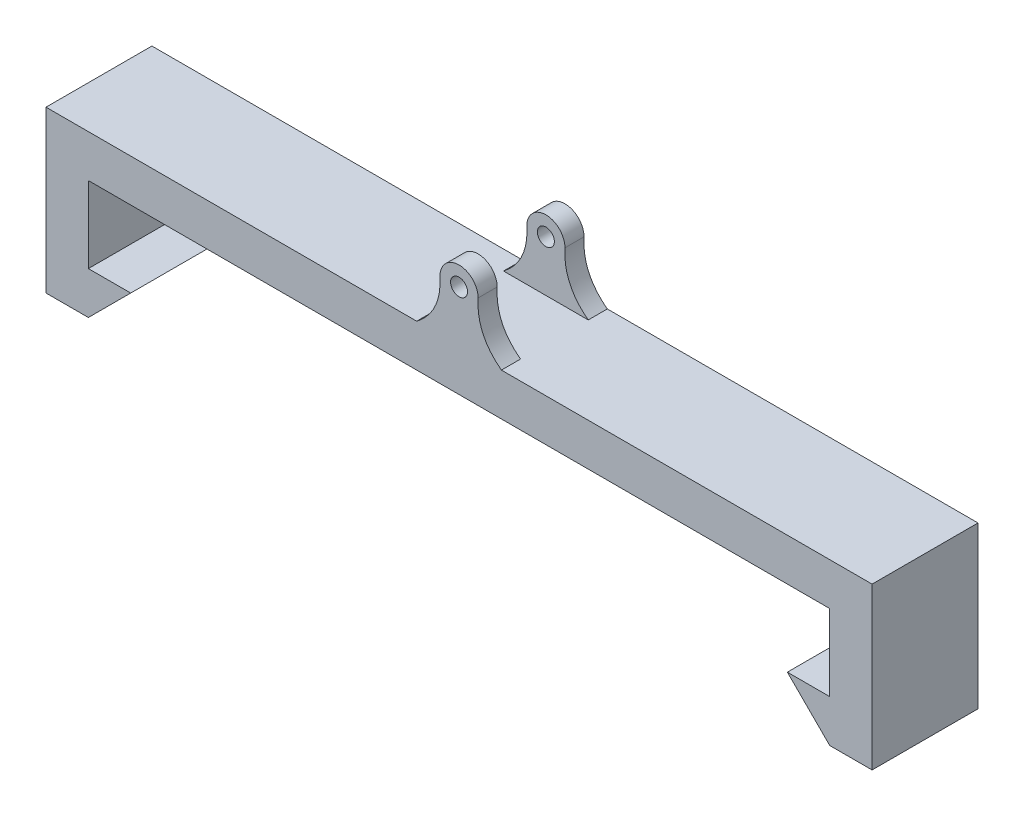
ISO-10303-21;
HEADER;
FILE_DESCRIPTION(('STEP AP214'),'2;1');
FILE_NAME('part.step','',(''),(''),'','','');
FILE_SCHEMA(('AUTOMOTIVE_DESIGN { 1 0 10303 214 1 1 1 1 }'));
ENDSEC;
DATA;
#1=APPLICATION_CONTEXT('core data for automotive mechanical design processes');
#2=APPLICATION_PROTOCOL_DEFINITION('international standard','automotive_design',2000,#1);
#3=PRODUCT_CONTEXT('',#1,'mechanical');
#4=PRODUCT('Part','Part','',(#3));
#5=PRODUCT_RELATED_PRODUCT_CATEGORY('part','',(#4));
#6=PRODUCT_DEFINITION_FORMATION('','',#4);
#7=PRODUCT_DEFINITION_CONTEXT('part definition',#1,'design');
#8=PRODUCT_DEFINITION('design','',#6,#7);
#9=PRODUCT_DEFINITION_SHAPE('','',#8);
#10=(LENGTH_UNIT() NAMED_UNIT(*) SI_UNIT(.MILLI.,.METRE.));
#11=(NAMED_UNIT(*) PLANE_ANGLE_UNIT() SI_UNIT($,.RADIAN.));
#12=(NAMED_UNIT(*) SI_UNIT($,.STERADIAN.) SOLID_ANGLE_UNIT());
#13=UNCERTAINTY_MEASURE_WITH_UNIT(LENGTH_MEASURE(1.E-05),#10,'distance_accuracy_value','');
#14=(GEOMETRIC_REPRESENTATION_CONTEXT(3) GLOBAL_UNCERTAINTY_ASSIGNED_CONTEXT((#13)) GLOBAL_UNIT_ASSIGNED_CONTEXT((#10,
#11,#12)) REPRESENTATION_CONTEXT('',''));
#15=CARTESIAN_POINT('',(0.,0.,0.));
#16=DIRECTION('',(0.,0.,1.));
#17=DIRECTION('',(1.,0.,0.));
#18=AXIS2_PLACEMENT_3D('',#15,#16,#17);
#19=CARTESIAN_POINT('',(0.,0.,25.));
#20=DIRECTION('',(0.,-1.,0.));
#21=DIRECTION('',(0.,0.,-1.));
#22=AXIS2_PLACEMENT_3D('',#19,#20,#21);
#23=PLANE('',#22);
#24=DIRECTION('',(-1.,0.,0.));
#25=VECTOR('',#24,1.);
#26=CARTESIAN_POINT('',(0.,0.,0.));
#27=LINE('',#26,#25);
#28=CARTESIAN_POINT('',(195.,0.,0.));
#29=VERTEX_POINT('',#28);
#30=CARTESIAN_POINT('',(107.5,0.,0.));
#31=VERTEX_POINT('',#30);
#32=EDGE_CURVE('E377',#29,#31,#27,.T.);
#33=ORIENTED_EDGE('',*,*,#32,.T.);
#34=DIRECTION('',(0.,0.,-1.));
#35=VECTOR('',#34,1.);
#36=CARTESIAN_POINT('',(107.5,0.,4.5));
#37=LINE('',#36,#35);
#38=CARTESIAN_POINT('',(107.5,0.,4.5));
#39=VERTEX_POINT('',#38);
#40=EDGE_CURVE('E57',#39,#31,#37,.T.);
#41=ORIENTED_EDGE('',*,*,#40,.F.);
#42=DIRECTION('',(-1.,0.,0.));
#43=VECTOR('',#42,1.);
#44=CARTESIAN_POINT('',(97.5,0.,4.5));
#45=LINE('',#44,#43);
#46=CARTESIAN_POINT('',(87.5,0.,4.5));
#47=VERTEX_POINT('',#46);
#48=EDGE_CURVE('E52',#39,#47,#45,.T.);
#49=ORIENTED_EDGE('',*,*,#48,.T.);
#50=DIRECTION('',(0.,0.,-1.));
#51=VECTOR('',#50,1.);
#52=CARTESIAN_POINT('',(87.5,0.,4.5));
#53=LINE('',#52,#51);
#54=CARTESIAN_POINT('',(87.5,0.,0.));
#55=VERTEX_POINT('',#54);
#56=EDGE_CURVE('E184',#47,#55,#53,.T.);
#57=ORIENTED_EDGE('',*,*,#56,.T.);
#58=CARTESIAN_POINT('',(0.,0.,0.));
#59=VERTEX_POINT('',#58);
#60=EDGE_CURVE('E376',#55,#59,#27,.T.);
#61=ORIENTED_EDGE('',*,*,#60,.T.);
#62=DIRECTION('',(0.,0.,-1.));
#63=VECTOR('',#62,1.);
#64=CARTESIAN_POINT('',(0.,0.,25.));
#65=LINE('',#64,#63);
#66=CARTESIAN_POINT('',(0.,0.,25.));
#67=VERTEX_POINT('',#66);
#68=EDGE_CURVE('E379',#67,#59,#65,.T.);
#69=ORIENTED_EDGE('',*,*,#68,.F.);
#70=DIRECTION('',(-1.,0.,0.));
#71=VECTOR('',#70,1.);
#72=CARTESIAN_POINT('',(0.,0.,25.));
#73=LINE('',#72,#71);
#74=CARTESIAN_POINT('',(87.5,0.,25.));
#75=VERTEX_POINT('',#74);
#76=EDGE_CURVE('E411',#75,#67,#73,.T.);
#77=ORIENTED_EDGE('',*,*,#76,.F.);
#78=DIRECTION('',(0.,0.,1.));
#79=VECTOR('',#78,1.);
#80=CARTESIAN_POINT('',(87.5,0.,20.5));
#81=LINE('',#80,#79);
#82=CARTESIAN_POINT('',(87.5,0.,20.5));
#83=VERTEX_POINT('',#82);
#84=EDGE_CURVE('E249',#83,#75,#81,.T.);
#85=ORIENTED_EDGE('',*,*,#84,.F.);
#86=DIRECTION('',(1.,0.,0.));
#87=VECTOR('',#86,1.);
#88=CARTESIAN_POINT('',(97.5,0.,20.5));
#89=LINE('',#88,#87);
#90=CARTESIAN_POINT('',(107.5,0.,20.5));
#91=VERTEX_POINT('',#90);
#92=EDGE_CURVE('E268',#83,#91,#89,.T.);
#93=ORIENTED_EDGE('',*,*,#92,.T.);
#94=DIRECTION('',(0.,0.,1.));
#95=VECTOR('',#94,1.);
#96=CARTESIAN_POINT('',(107.5,0.,20.5));
#97=LINE('',#96,#95);
#98=CARTESIAN_POINT('',(107.5,0.,25.));
#99=VERTEX_POINT('',#98);
#100=EDGE_CURVE('E236',#91,#99,#97,.T.);
#101=ORIENTED_EDGE('',*,*,#100,.T.);
#102=CARTESIAN_POINT('',(195.,0.,25.));
#103=VERTEX_POINT('',#102);
#104=EDGE_CURVE('E383',#103,#99,#73,.T.);
#105=ORIENTED_EDGE('',*,*,#104,.F.);
#106=DIRECTION('',(0.,0.,-1.));
#107=VECTOR('',#106,1.);
#108=CARTESIAN_POINT('',(195.,0.,25.));
#109=LINE('',#108,#107);
#110=EDGE_CURVE('E382',#103,#29,#109,.T.);
#111=ORIENTED_EDGE('',*,*,#110,.T.);
#112=EDGE_LOOP('',(#33,#41,#49,#57,#61,#69,#77,#85,#93,#101,#105,#111));
#113=FACE_BOUND('',#112,.T.);
#114=ADVANCED_FACE('F33',(#113),#23,.F.);
#115=CARTESIAN_POINT('',(0.,0.,25.));
#116=DIRECTION('',(1.,0.,0.));
#117=DIRECTION('',(0.,0.,-1.));
#118=AXIS2_PLACEMENT_3D('',#115,#116,#117);
#119=PLANE('',#118);
#120=DIRECTION('',(0.,-1.,0.));
#121=VECTOR('',#120,1.);
#122=CARTESIAN_POINT('',(0.,0.,0.));
#123=LINE('',#122,#121);
#124=CARTESIAN_POINT('',(0.,-38.,0.));
#125=VERTEX_POINT('',#124);
#126=EDGE_CURVE('E265',#59,#125,#123,.T.);
#127=ORIENTED_EDGE('',*,*,#126,.T.);
#128=DIRECTION('',(0.,0.,-1.));
#129=VECTOR('',#128,1.);
#130=CARTESIAN_POINT('',(0.,-38.,25.));
#131=LINE('',#130,#129);
#132=CARTESIAN_POINT('',(0.,-38.,25.));
#133=VERTEX_POINT('',#132);
#134=EDGE_CURVE('E11',#133,#125,#131,.T.);
#135=ORIENTED_EDGE('',*,*,#134,.F.);
#136=DIRECTION('',(0.,-1.,0.));
#137=VECTOR('',#136,1.);
#138=CARTESIAN_POINT('',(0.,0.,25.));
#139=LINE('',#138,#137);
#140=EDGE_CURVE('E254',#67,#133,#139,.T.);
#141=ORIENTED_EDGE('',*,*,#140,.F.);
#142=ORIENTED_EDGE('',*,*,#68,.T.);
#143=EDGE_LOOP('',(#127,#135,#141,#142));
#144=FACE_BOUND('',#143,.T.);
#145=ADVANCED_FACE('F35',(#144),#119,.F.);
#146=CARTESIAN_POINT('',(0.,-38.,25.));
#147=DIRECTION('',(0.,1.,0.));
#148=DIRECTION('',(0.,0.,1.));
#149=AXIS2_PLACEMENT_3D('',#146,#147,#148);
#150=PLANE('',#149);
#151=DIRECTION('',(1.,0.,0.));
#152=VECTOR('',#151,1.);
#153=CARTESIAN_POINT('',(0.,-38.,0.));
#154=LINE('',#153,#152);
#155=CARTESIAN_POINT('',(10.,-38.,0.));
#156=VERTEX_POINT('',#155);
#157=EDGE_CURVE('E340',#125,#156,#154,.T.);
#158=ORIENTED_EDGE('',*,*,#157,.T.);
#159=DIRECTION('',(0.,0.,-1.));
#160=VECTOR('',#159,1.);
#161=CARTESIAN_POINT('',(10.,-38.,25.));
#162=LINE('',#161,#160);
#163=CARTESIAN_POINT('',(10.,-38.,25.));
#164=VERTEX_POINT('',#163);
#165=EDGE_CURVE('E44',#164,#156,#162,.T.);
#166=ORIENTED_EDGE('',*,*,#165,.F.);
#167=DIRECTION('',(1.,0.,0.));
#168=VECTOR('',#167,1.);
#169=CARTESIAN_POINT('',(0.,-38.,25.));
#170=LINE('',#169,#168);
#171=EDGE_CURVE('E639',#133,#164,#170,.T.);
#172=ORIENTED_EDGE('',*,*,#171,.F.);
#173=ORIENTED_EDGE('',*,*,#134,.T.);
#174=EDGE_LOOP('',(#158,#166,#172,#173));
#175=FACE_BOUND('',#174,.T.);
#176=ADVANCED_FACE('F331',(#175),#150,.F.);
#177=CARTESIAN_POINT('',(20.,-28.,25.));
#178=DIRECTION('',(-0.707106781186547,0.707106781186548,0.));
#179=DIRECTION('',(-0.707106781186548,-0.707106781186547,0.));
#180=AXIS2_PLACEMENT_3D('',#177,#178,#179);
#181=PLANE('',#180);
#182=DIRECTION('',(0.707106781186548,0.707106781186547,0.));
#183=VECTOR('',#182,1.);
#184=CARTESIAN_POINT('',(20.,-28.,0.));
#185=LINE('',#184,#183);
#186=CARTESIAN_POINT('',(20.,-28.,0.));
#187=VERTEX_POINT('',#186);
#188=EDGE_CURVE('E347',#156,#187,#185,.T.);
#189=ORIENTED_EDGE('',*,*,#188,.T.);
#190=DIRECTION('',(0.,0.,-1.));
#191=VECTOR('',#190,1.);
#192=CARTESIAN_POINT('',(20.,-28.,25.));
#193=LINE('',#192,#191);
#194=CARTESIAN_POINT('',(20.,-28.,25.));
#195=VERTEX_POINT('',#194);
#196=EDGE_CURVE('E352',#195,#187,#193,.T.);
#197=ORIENTED_EDGE('',*,*,#196,.F.);
#198=DIRECTION('',(0.707106781186548,0.707106781186547,0.));
#199=VECTOR('',#198,1.);
#200=CARTESIAN_POINT('',(20.,-28.,25.));
#201=LINE('',#200,#199);
#202=EDGE_CURVE('E351',#164,#195,#201,.T.);
#203=ORIENTED_EDGE('',*,*,#202,.F.);
#204=ORIENTED_EDGE('',*,*,#165,.T.);
#205=EDGE_LOOP('',(#189,#197,#203,#204));
#206=FACE_BOUND('',#205,.T.);
#207=ADVANCED_FACE('F328',(#206),#181,.F.);
#208=CARTESIAN_POINT('',(10.,-28.,25.));
#209=DIRECTION('',(0.,-1.,0.));
#210=DIRECTION('',(0.,0.,-1.));
#211=AXIS2_PLACEMENT_3D('',#208,#209,#210);
#212=PLANE('',#211);
#213=DIRECTION('',(-1.,0.,0.));
#214=VECTOR('',#213,1.);
#215=CARTESIAN_POINT('',(10.,-28.,0.));
#216=LINE('',#215,#214);
#217=CARTESIAN_POINT('',(10.,-28.,0.));
#218=VERTEX_POINT('',#217);
#219=EDGE_CURVE('E357',#187,#218,#216,.T.);
#220=ORIENTED_EDGE('',*,*,#219,.T.);
#221=DIRECTION('',(0.,0.,-1.));
#222=VECTOR('',#221,1.);
#223=CARTESIAN_POINT('',(10.,-28.,25.));
#224=LINE('',#223,#222);
#225=CARTESIAN_POINT('',(10.,-28.,25.));
#226=VERTEX_POINT('',#225);
#227=EDGE_CURVE('E404',#226,#218,#224,.T.);
#228=ORIENTED_EDGE('',*,*,#227,.F.);
#229=DIRECTION('',(-1.,0.,0.));
#230=VECTOR('',#229,1.);
#231=CARTESIAN_POINT('',(10.,-28.,25.));
#232=LINE('',#231,#230);
#233=EDGE_CURVE('E637',#195,#226,#232,.T.);
#234=ORIENTED_EDGE('',*,*,#233,.F.);
#235=ORIENTED_EDGE('',*,*,#196,.T.);
#236=EDGE_LOOP('',(#220,#228,#234,#235));
#237=FACE_BOUND('',#236,.T.);
#238=ADVANCED_FACE('F324',(#237),#212,.F.);
#239=CARTESIAN_POINT('',(10.,-28.,25.));
#240=DIRECTION('',(-1.,0.,0.));
#241=DIRECTION('',(0.,-1.,0.));
#242=AXIS2_PLACEMENT_3D('',#239,#240,#241);
#243=PLANE('',#242);
#244=DIRECTION('',(0.,1.,0.));
#245=VECTOR('',#244,1.);
#246=CARTESIAN_POINT('',(10.,-28.,0.));
#247=LINE('',#246,#245);
#248=CARTESIAN_POINT('',(10.,-10.,0.));
#249=VERTEX_POINT('',#248);
#250=EDGE_CURVE('E359',#218,#249,#247,.T.);
#251=ORIENTED_EDGE('',*,*,#250,.T.);
#252=DIRECTION('',(0.,0.,-1.));
#253=VECTOR('',#252,1.);
#254=CARTESIAN_POINT('',(10.,-10.,25.));
#255=LINE('',#254,#253);
#256=CARTESIAN_POINT('',(10.,-10.,25.));
#257=VERTEX_POINT('',#256);
#258=EDGE_CURVE('E401',#257,#249,#255,.T.);
#259=ORIENTED_EDGE('',*,*,#258,.F.);
#260=DIRECTION('',(0.,1.,0.));
#261=VECTOR('',#260,1.);
#262=CARTESIAN_POINT('',(10.,-28.,25.));
#263=LINE('',#262,#261);
#264=EDGE_CURVE('E635',#226,#257,#263,.T.);
#265=ORIENTED_EDGE('',*,*,#264,.F.);
#266=ORIENTED_EDGE('',*,*,#227,.T.);
#267=EDGE_LOOP('',(#251,#259,#265,#266));
#268=FACE_BOUND('',#267,.T.);
#269=ADVANCED_FACE('F320',(#268),#243,.F.);
#270=CARTESIAN_POINT('',(10.,-10.,25.));
#271=DIRECTION('',(0.,1.,0.));
#272=DIRECTION('',(0.,0.,1.));
#273=AXIS2_PLACEMENT_3D('',#270,#271,#272);
#274=PLANE('',#273);
#275=DIRECTION('',(1.,0.,0.));
#276=VECTOR('',#275,1.);
#277=CARTESIAN_POINT('',(10.,-10.,0.));
#278=LINE('',#277,#276);
#279=CARTESIAN_POINT('',(185.,-10.,0.));
#280=VERTEX_POINT('',#279);
#281=EDGE_CURVE('E364',#249,#280,#278,.T.);
#282=ORIENTED_EDGE('',*,*,#281,.T.);
#283=DIRECTION('',(0.,0.,-1.));
#284=VECTOR('',#283,1.);
#285=CARTESIAN_POINT('',(185.,-10.,25.));
#286=LINE('',#285,#284);
#287=CARTESIAN_POINT('',(185.,-10.,25.));
#288=VERTEX_POINT('',#287);
#289=EDGE_CURVE('E398',#288,#280,#286,.T.);
#290=ORIENTED_EDGE('',*,*,#289,.F.);
#291=DIRECTION('',(1.,0.,0.));
#292=VECTOR('',#291,1.);
#293=CARTESIAN_POINT('',(10.,-10.,25.));
#294=LINE('',#293,#292);
#295=EDGE_CURVE('E633',#257,#288,#294,.T.);
#296=ORIENTED_EDGE('',*,*,#295,.F.);
#297=ORIENTED_EDGE('',*,*,#258,.T.);
#298=EDGE_LOOP('',(#282,#290,#296,#297));
#299=FACE_BOUND('',#298,.T.);
#300=ADVANCED_FACE('F316',(#299),#274,.F.);
#301=CARTESIAN_POINT('',(185.,-10.,25.));
#302=DIRECTION('',(1.,0.,0.));
#303=DIRECTION('',(0.,0.,-1.));
#304=AXIS2_PLACEMENT_3D('',#301,#302,#303);
#305=PLANE('',#304);
#306=DIRECTION('',(0.,-1.,0.));
#307=VECTOR('',#306,1.);
#308=CARTESIAN_POINT('',(185.,-10.,0.));
#309=LINE('',#308,#307);
#310=CARTESIAN_POINT('',(185.,-28.,0.));
#311=VERTEX_POINT('',#310);
#312=EDGE_CURVE('E366',#280,#311,#309,.T.);
#313=ORIENTED_EDGE('',*,*,#312,.T.);
#314=DIRECTION('',(0.,0.,-1.));
#315=VECTOR('',#314,1.);
#316=CARTESIAN_POINT('',(185.,-28.,25.));
#317=LINE('',#316,#315);
#318=CARTESIAN_POINT('',(185.,-28.,25.));
#319=VERTEX_POINT('',#318);
#320=EDGE_CURVE('E395',#319,#311,#317,.T.);
#321=ORIENTED_EDGE('',*,*,#320,.F.);
#322=DIRECTION('',(0.,-1.,0.));
#323=VECTOR('',#322,1.);
#324=CARTESIAN_POINT('',(185.,-10.,25.));
#325=LINE('',#324,#323);
#326=EDGE_CURVE('E631',#288,#319,#325,.T.);
#327=ORIENTED_EDGE('',*,*,#326,.F.);
#328=ORIENTED_EDGE('',*,*,#289,.T.);
#329=EDGE_LOOP('',(#313,#321,#327,#328));
#330=FACE_BOUND('',#329,.T.);
#331=ADVANCED_FACE('F312',(#330),#305,.F.);
#332=CARTESIAN_POINT('',(185.,-28.,25.));
#333=DIRECTION('',(0.,-1.,0.));
#334=DIRECTION('',(0.,0.,-1.));
#335=AXIS2_PLACEMENT_3D('',#332,#333,#334);
#336=PLANE('',#335);
#337=DIRECTION('',(-1.,0.,0.));
#338=VECTOR('',#337,1.);
#339=CARTESIAN_POINT('',(185.,-28.,0.));
#340=LINE('',#339,#338);
#341=CARTESIAN_POINT('',(175.,-28.,0.));
#342=VERTEX_POINT('',#341);
#343=EDGE_CURVE('E368',#311,#342,#340,.T.);
#344=ORIENTED_EDGE('',*,*,#343,.T.);
#345=DIRECTION('',(0.,0.,-1.));
#346=VECTOR('',#345,1.);
#347=CARTESIAN_POINT('',(175.,-28.,25.));
#348=LINE('',#347,#346);
#349=CARTESIAN_POINT('',(175.,-28.,25.));
#350=VERTEX_POINT('',#349);
#351=EDGE_CURVE('E392',#350,#342,#348,.T.);
#352=ORIENTED_EDGE('',*,*,#351,.F.);
#353=DIRECTION('',(-1.,0.,0.));
#354=VECTOR('',#353,1.);
#355=CARTESIAN_POINT('',(185.,-28.,25.));
#356=LINE('',#355,#354);
#357=EDGE_CURVE('E627',#319,#350,#356,.T.);
#358=ORIENTED_EDGE('',*,*,#357,.F.);
#359=ORIENTED_EDGE('',*,*,#320,.T.);
#360=EDGE_LOOP('',(#344,#352,#358,#359));
#361=FACE_BOUND('',#360,.T.);
#362=ADVANCED_FACE('F308',(#361),#336,.F.);
#363=CARTESIAN_POINT('',(185.,-38.,25.));
#364=DIRECTION('',(0.707106781186547,0.707106781186548,0.));
#365=DIRECTION('',(-0.707106781186548,0.707106781186547,0.));
#366=AXIS2_PLACEMENT_3D('',#363,#364,#365);
#367=PLANE('',#366);
#368=DIRECTION('',(0.707106781186548,-0.707106781186547,0.));
#369=VECTOR('',#368,1.);
#370=CARTESIAN_POINT('',(185.,-38.,0.));
#371=LINE('',#370,#369);
#372=CARTESIAN_POINT('',(185.,-38.,0.));
#373=VERTEX_POINT('',#372);
#374=EDGE_CURVE('E370',#342,#373,#371,.T.);
#375=ORIENTED_EDGE('',*,*,#374,.T.);
#376=DIRECTION('',(0.,0.,-1.));
#377=VECTOR('',#376,1.);
#378=CARTESIAN_POINT('',(185.,-38.,25.));
#379=LINE('',#378,#377);
#380=CARTESIAN_POINT('',(185.,-38.,25.));
#381=VERTEX_POINT('',#380);
#382=EDGE_CURVE('E389',#381,#373,#379,.T.);
#383=ORIENTED_EDGE('',*,*,#382,.F.);
#384=DIRECTION('',(0.707106781186548,-0.707106781186547,0.));
#385=VECTOR('',#384,1.);
#386=CARTESIAN_POINT('',(185.,-38.,25.));
#387=LINE('',#386,#385);
#388=EDGE_CURVE('E624',#350,#381,#387,.T.);
#389=ORIENTED_EDGE('',*,*,#388,.F.);
#390=ORIENTED_EDGE('',*,*,#351,.T.);
#391=EDGE_LOOP('',(#375,#383,#389,#390));
#392=FACE_BOUND('',#391,.T.);
#393=ADVANCED_FACE('F304',(#392),#367,.F.);
#394=CARTESIAN_POINT('',(195.,-38.,25.));
#395=DIRECTION('',(0.,1.,0.));
#396=DIRECTION('',(0.,0.,1.));
#397=AXIS2_PLACEMENT_3D('',#394,#395,#396);
#398=PLANE('',#397);
#399=DIRECTION('',(1.,0.,0.));
#400=VECTOR('',#399,1.);
#401=CARTESIAN_POINT('',(195.,-38.,0.));
#402=LINE('',#401,#400);
#403=CARTESIAN_POINT('',(195.,-38.,0.));
#404=VERTEX_POINT('',#403);
#405=EDGE_CURVE('E372',#373,#404,#402,.T.);
#406=ORIENTED_EDGE('',*,*,#405,.T.);
#407=DIRECTION('',(0.,0.,-1.));
#408=VECTOR('',#407,1.);
#409=CARTESIAN_POINT('',(195.,-38.,25.));
#410=LINE('',#409,#408);
#411=CARTESIAN_POINT('',(195.,-38.,25.));
#412=VERTEX_POINT('',#411);
#413=EDGE_CURVE('E386',#412,#404,#410,.T.);
#414=ORIENTED_EDGE('',*,*,#413,.F.);
#415=DIRECTION('',(1.,0.,0.));
#416=VECTOR('',#415,1.);
#417=CARTESIAN_POINT('',(195.,-38.,25.));
#418=LINE('',#417,#416);
#419=EDGE_CURVE('E623',#381,#412,#418,.T.);
#420=ORIENTED_EDGE('',*,*,#419,.F.);
#421=ORIENTED_EDGE('',*,*,#382,.T.);
#422=EDGE_LOOP('',(#406,#414,#420,#421));
#423=FACE_BOUND('',#422,.T.);
#424=ADVANCED_FACE('F300',(#423),#398,.F.);
#425=CARTESIAN_POINT('',(195.,0.,25.));
#426=DIRECTION('',(-1.,0.,0.));
#427=DIRECTION('',(0.,0.,1.));
#428=AXIS2_PLACEMENT_3D('',#425,#426,#427);
#429=PLANE('',#428);
#430=DIRECTION('',(0.,1.,0.));
#431=VECTOR('',#430,1.);
#432=CARTESIAN_POINT('',(195.,0.,0.));
#433=LINE('',#432,#431);
#434=EDGE_CURVE('E374',#404,#29,#433,.T.);
#435=ORIENTED_EDGE('',*,*,#434,.T.);
#436=ORIENTED_EDGE('',*,*,#110,.F.);
#437=DIRECTION('',(0.,1.,0.));
#438=VECTOR('',#437,1.);
#439=CARTESIAN_POINT('',(195.,0.,25.));
#440=LINE('',#439,#438);
#441=EDGE_CURVE('E414',#412,#103,#440,.T.);
#442=ORIENTED_EDGE('',*,*,#441,.F.);
#443=ORIENTED_EDGE('',*,*,#413,.T.);
#444=EDGE_LOOP('',(#435,#436,#442,#443));
#445=FACE_BOUND('',#444,.T.);
#446=ADVANCED_FACE('F292',(#445),#429,.F.);
#447=CARTESIAN_POINT('',(0.,0.,25.));
#448=DIRECTION('',(0.,0.,1.));
#449=DIRECTION('',(1.,0.,0.));
#450=AXIS2_PLACEMENT_3D('',#447,#448,#449);
#451=PLANE('',#450);
#452=ORIENTED_EDGE('',*,*,#140,.T.);
#453=ORIENTED_EDGE('',*,*,#171,.T.);
#454=ORIENTED_EDGE('',*,*,#202,.T.);
#455=ORIENTED_EDGE('',*,*,#233,.T.);
#456=ORIENTED_EDGE('',*,*,#264,.T.);
#457=ORIENTED_EDGE('',*,*,#295,.T.);
#458=ORIENTED_EDGE('',*,*,#326,.T.);
#459=ORIENTED_EDGE('',*,*,#357,.T.);
#460=ORIENTED_EDGE('',*,*,#388,.T.);
#461=ORIENTED_EDGE('',*,*,#419,.T.);
#462=ORIENTED_EDGE('',*,*,#441,.T.);
#463=ORIENTED_EDGE('',*,*,#104,.T.);
#464=CARTESIAN_POINT('',(107.5,0.,25.));
#465=CARTESIAN_POINT('',(101.526459375004,4.53010782495921,25.));
#466=CARTESIAN_POINT('',(102.,12.,25.));
#467=B_SPLINE_CURVE_WITH_KNOTS('',2,(#464,#465,#466),.UNSPECIFIED.,.F.,.F.,(3,3),(0.,1.),.UNSPECIFIED.);
#468=CARTESIAN_POINT('',(102.,12.,25.));
#469=VERTEX_POINT('',#468);
#470=EDGE_CURVE('E246',#99,#469,#467,.T.);
#471=ORIENTED_EDGE('',*,*,#470,.T.);
#472=CARTESIAN_POINT('',(97.5,12.,25.));
#473=DIRECTION('',(0.,0.,1.));
#474=DIRECTION('',(-1.,0.,0.));
#475=AXIS2_PLACEMENT_3D('',#472,#473,#474);
#476=CIRCLE('',#475,4.5);
#477=CARTESIAN_POINT('',(93.,12.,25.));
#478=VERTEX_POINT('',#477);
#479=EDGE_CURVE('E239',#469,#478,#476,.T.);
#480=ORIENTED_EDGE('',*,*,#479,.T.);
#481=CARTESIAN_POINT('',(93.,12.,25.));
#482=CARTESIAN_POINT('',(93.4735406249962,4.53010782495921,25.));
#483=CARTESIAN_POINT('',(87.5,0.,25.));
#484=B_SPLINE_CURVE_WITH_KNOTS('',2,(#481,#482,#483),.UNSPECIFIED.,.F.,.F.,(3,3),(0.,1.),.UNSPECIFIED.);
#485=EDGE_CURVE('E245',#478,#75,#484,.T.);
#486=ORIENTED_EDGE('',*,*,#485,.T.);
#487=ORIENTED_EDGE('',*,*,#76,.T.);
#488=EDGE_LOOP('',(#452,#453,#454,#455,#456,#457,#458,#459,#460,#461,#462,#463,#471,#480,#486,#487));
#489=FACE_BOUND('',#488,.T.);
#490=CARTESIAN_POINT('',(97.5,12.,25.));
#491=DIRECTION('',(0.,0.,1.));
#492=DIRECTION('',(1.,0.,0.));
#493=AXIS2_PLACEMENT_3D('',#490,#491,#492);
#494=CIRCLE('',#493,2.);
#495=CARTESIAN_POINT('',(99.5,12.,25.));
#496=VERTEX_POINT('',#495);
#497=EDGE_CURVE('E278',#496,#496,#494,.T.);
#498=ORIENTED_EDGE('',*,*,#497,.F.);
#499=EDGE_LOOP('',(#498));
#500=FACE_BOUND('',#499,.T.);
#501=ADVANCED_FACE('F289',(#489,#500),#451,.T.);
#502=CARTESIAN_POINT('',(0.,0.,0.));
#503=DIRECTION('',(0.,0.,1.));
#504=DIRECTION('',(1.,0.,0.));
#505=AXIS2_PLACEMENT_3D('',#502,#503,#504);
#506=PLANE('',#505);
#507=ORIENTED_EDGE('',*,*,#126,.F.);
#508=ORIENTED_EDGE('',*,*,#60,.F.);
#509=CARTESIAN_POINT('',(87.5,0.,0.));
#510=CARTESIAN_POINT('',(93.4722102437593,4.52718973428302,0.));
#511=CARTESIAN_POINT('',(93.,12.,0.));
#512=B_SPLINE_CURVE_WITH_KNOTS('',2,(#509,#510,#511),.UNSPECIFIED.,.F.,.F.,(3,3),(0.,1.),.UNSPECIFIED.);
#513=CARTESIAN_POINT('',(93.,12.,0.));
#514=VERTEX_POINT('',#513);
#515=EDGE_CURVE('E419',#55,#514,#512,.T.);
#516=ORIENTED_EDGE('',*,*,#515,.T.);
#517=CARTESIAN_POINT('',(97.5,12.,0.));
#518=DIRECTION('',(0.,0.,-1.));
#519=DIRECTION('',(1.,0.,0.));
#520=AXIS2_PLACEMENT_3D('',#517,#518,#519);
#521=CIRCLE('',#520,4.5);
#522=CARTESIAN_POINT('',(102.,12.,0.));
#523=VERTEX_POINT('',#522);
#524=EDGE_CURVE('E178',#514,#523,#521,.T.);
#525=ORIENTED_EDGE('',*,*,#524,.T.);
#526=CARTESIAN_POINT('',(102.,12.,0.));
#527=CARTESIAN_POINT('',(101.527789756368,4.52718973402621,0.));
#528=CARTESIAN_POINT('',(107.5,0.,0.));
#529=B_SPLINE_CURVE_WITH_KNOTS('',2,(#526,#527,#528),.UNSPECIFIED.,.F.,.F.,(3,3),(0.,1.),.UNSPECIFIED.);
#530=EDGE_CURVE('E196',#523,#31,#529,.T.);
#531=ORIENTED_EDGE('',*,*,#530,.T.);
#532=ORIENTED_EDGE('',*,*,#32,.F.);
#533=ORIENTED_EDGE('',*,*,#434,.F.);
#534=ORIENTED_EDGE('',*,*,#405,.F.);
#535=ORIENTED_EDGE('',*,*,#374,.F.);
#536=ORIENTED_EDGE('',*,*,#343,.F.);
#537=ORIENTED_EDGE('',*,*,#312,.F.);
#538=ORIENTED_EDGE('',*,*,#281,.F.);
#539=ORIENTED_EDGE('',*,*,#250,.F.);
#540=ORIENTED_EDGE('',*,*,#219,.F.);
#541=ORIENTED_EDGE('',*,*,#188,.F.);
#542=ORIENTED_EDGE('',*,*,#157,.F.);
#543=EDGE_LOOP('',(#507,#508,#516,#525,#531,#532,#533,#534,#535,#536,#537,#538,#539,#540,#541,#542));
#544=FACE_BOUND('',#543,.T.);
#545=CARTESIAN_POINT('',(97.5,12.,0.));
#546=DIRECTION('',(0.,0.,-1.));
#547=DIRECTION('',(-1.,0.,0.));
#548=AXIS2_PLACEMENT_3D('',#545,#546,#547);
#549=CIRCLE('',#548,1.99999999999794);
#550=CARTESIAN_POINT('',(95.5000000000021,12.,0.));
#551=VERTEX_POINT('',#550);
#552=EDGE_CURVE('E425',#551,#551,#549,.T.);
#553=ORIENTED_EDGE('',*,*,#552,.F.);
#554=EDGE_LOOP('',(#553));
#555=FACE_BOUND('',#554,.T.);
#556=ADVANCED_FACE('F226',(#544,#555),#506,.F.);
#557=CARTESIAN_POINT('',(93.,12.,20.5));
#558=CARTESIAN_POINT('',(93.4735406249962,4.53010782495921,20.5));
#559=CARTESIAN_POINT('',(87.5,0.,20.5));
#560=B_SPLINE_CURVE_WITH_KNOTS('',2,(#557,#558,#559),.UNSPECIFIED.,.F.,.F.,(3,3),(0.,1.),.UNSPECIFIED.);
#561=DIRECTION('',(0.,0.,1.));
#562=VECTOR('',#561,1.);
#563=SURFACE_OF_LINEAR_EXTRUSION('',#560,#562);
#564=ORIENTED_EDGE('',*,*,#485,.F.);
#565=DIRECTION('',(0.,0.,1.));
#566=VECTOR('',#565,1.);
#567=CARTESIAN_POINT('',(93.,12.,20.5));
#568=LINE('',#567,#566);
#569=CARTESIAN_POINT('',(93.,12.,20.5));
#570=VERTEX_POINT('',#569);
#571=EDGE_CURVE('E247',#570,#478,#568,.T.);
#572=ORIENTED_EDGE('',*,*,#571,.F.);
#573=EDGE_CURVE('E229',#570,#83,#560,.T.);
#574=ORIENTED_EDGE('',*,*,#573,.T.);
#575=ORIENTED_EDGE('',*,*,#84,.T.);
#576=EDGE_LOOP('',(#564,#572,#574,#575));
#577=FACE_BOUND('',#576,.T.);
#578=ADVANCED_FACE('F221',(#577),#563,.T.);
#579=CARTESIAN_POINT('',(97.5,12.,20.5));
#580=DIRECTION('',(0.,0.,1.));
#581=DIRECTION('',(1.,0.,0.));
#582=AXIS2_PLACEMENT_3D('',#579,#580,#581);
#583=CYLINDRICAL_SURFACE('',#582,4.5);
#584=ORIENTED_EDGE('',*,*,#479,.F.);
#585=DIRECTION('',(0.,0.,1.));
#586=VECTOR('',#585,1.);
#587=CARTESIAN_POINT('',(102.,12.,20.5));
#588=LINE('',#587,#586);
#589=CARTESIAN_POINT('',(102.,12.,20.5));
#590=VERTEX_POINT('',#589);
#591=EDGE_CURVE('E250',#590,#469,#588,.T.);
#592=ORIENTED_EDGE('',*,*,#591,.F.);
#593=CARTESIAN_POINT('',(97.5,12.,20.5));
#594=DIRECTION('',(0.,0.,1.));
#595=DIRECTION('',(-1.,0.,0.));
#596=AXIS2_PLACEMENT_3D('',#593,#594,#595);
#597=CIRCLE('',#596,4.5);
#598=EDGE_CURVE('E237',#590,#570,#597,.T.);
#599=ORIENTED_EDGE('',*,*,#598,.T.);
#600=ORIENTED_EDGE('',*,*,#571,.T.);
#601=EDGE_LOOP('',(#584,#592,#599,#600));
#602=FACE_BOUND('',#601,.T.);
#603=ADVANCED_FACE('F225',(#602),#583,.T.);
#604=CARTESIAN_POINT('',(107.5,0.,20.5));
#605=CARTESIAN_POINT('',(101.526459375004,4.53010782495921,20.5));
#606=CARTESIAN_POINT('',(102.,12.,20.5));
#607=B_SPLINE_CURVE_WITH_KNOTS('',2,(#604,#605,#606),.UNSPECIFIED.,.F.,.F.,(3,3),(0.,1.),.UNSPECIFIED.);
#608=DIRECTION('',(0.,0.,1.));
#609=VECTOR('',#608,1.);
#610=SURFACE_OF_LINEAR_EXTRUSION('',#607,#609);
#611=ORIENTED_EDGE('',*,*,#470,.F.);
#612=ORIENTED_EDGE('',*,*,#100,.F.);
#613=EDGE_CURVE('E273',#91,#590,#607,.T.);
#614=ORIENTED_EDGE('',*,*,#613,.T.);
#615=ORIENTED_EDGE('',*,*,#591,.T.);
#616=EDGE_LOOP('',(#611,#612,#614,#615));
#617=FACE_BOUND('',#616,.T.);
#618=ADVANCED_FACE('F219',(#617),#610,.T.);
#619=CARTESIAN_POINT('',(103.138229687502,5.26505391247959,20.5));
#620=DIRECTION('',(0.,0.,-1.));
#621=DIRECTION('',(-1.,0.,0.));
#622=AXIS2_PLACEMENT_3D('',#619,#620,#621);
#623=PLANE('',#622);
#624=CARTESIAN_POINT('',(97.5,12.,20.5));
#625=DIRECTION('',(0.,0.,1.));
#626=DIRECTION('',(1.,0.,0.));
#627=AXIS2_PLACEMENT_3D('',#624,#625,#626);
#628=CIRCLE('',#627,2.);
#629=CARTESIAN_POINT('',(99.5,12.,20.5));
#630=VERTEX_POINT('',#629);
#631=EDGE_CURVE('E444',#630,#630,#628,.T.);
#632=ORIENTED_EDGE('',*,*,#631,.T.);
#633=EDGE_LOOP('',(#632));
#634=FACE_BOUND('',#633,.T.);
#635=ORIENTED_EDGE('',*,*,#92,.F.);
#636=ORIENTED_EDGE('',*,*,#573,.F.);
#637=ORIENTED_EDGE('',*,*,#598,.F.);
#638=ORIENTED_EDGE('',*,*,#613,.F.);
#639=EDGE_LOOP('',(#635,#636,#637,#638));
#640=FACE_BOUND('',#639,.T.);
#641=ADVANCED_FACE('F215',(#634,#640),#623,.T.);
#642=CARTESIAN_POINT('',(97.5,12.,20.5));
#643=DIRECTION('',(0.,0.,1.));
#644=DIRECTION('',(1.,0.,0.));
#645=AXIS2_PLACEMENT_3D('',#642,#643,#644);
#646=CYLINDRICAL_SURFACE('',#645,2.);
#647=ORIENTED_EDGE('',*,*,#631,.F.);
#648=EDGE_LOOP('',(#647));
#649=FACE_BOUND('',#648,.T.);
#650=ORIENTED_EDGE('',*,*,#497,.T.);
#651=EDGE_LOOP('',(#650));
#652=FACE_BOUND('',#651,.T.);
#653=ADVANCED_FACE('F211',(#649,#652),#646,.F.);
#654=CARTESIAN_POINT('',(102.,12.,4.5));
#655=CARTESIAN_POINT('',(101.527789756368,4.52718973402621,4.5));
#656=CARTESIAN_POINT('',(107.5,0.,4.5));
#657=B_SPLINE_CURVE_WITH_KNOTS('',2,(#654,#655,#656),.UNSPECIFIED.,.F.,.F.,(3,3),(0.,1.),.UNSPECIFIED.);
#658=DIRECTION('',(0.,0.,-1.));
#659=VECTOR('',#658,1.);
#660=SURFACE_OF_LINEAR_EXTRUSION('',#657,#659);
#661=ORIENTED_EDGE('',*,*,#530,.F.);
#662=DIRECTION('',(0.,0.,-1.));
#663=VECTOR('',#662,1.);
#664=CARTESIAN_POINT('',(102.,12.,4.5));
#665=LINE('',#664,#663);
#666=CARTESIAN_POINT('',(102.,12.,4.5));
#667=VERTEX_POINT('',#666);
#668=EDGE_CURVE('E183',#667,#523,#665,.T.);
#669=ORIENTED_EDGE('',*,*,#668,.F.);
#670=EDGE_CURVE('E192',#667,#39,#657,.T.);
#671=ORIENTED_EDGE('',*,*,#670,.T.);
#672=ORIENTED_EDGE('',*,*,#40,.T.);
#673=EDGE_LOOP('',(#661,#669,#671,#672));
#674=FACE_BOUND('',#673,.T.);
#675=ADVANCED_FACE('F214',(#674),#660,.T.);
#676=CARTESIAN_POINT('',(97.5,12.,4.5));
#677=DIRECTION('',(0.,0.,-1.));
#678=DIRECTION('',(-1.,0.,0.));
#679=AXIS2_PLACEMENT_3D('',#676,#677,#678);
#680=CYLINDRICAL_SURFACE('',#679,4.5);
#681=ORIENTED_EDGE('',*,*,#524,.F.);
#682=DIRECTION('',(0.,0.,-1.));
#683=VECTOR('',#682,1.);
#684=CARTESIAN_POINT('',(93.,12.,4.5));
#685=LINE('',#684,#683);
#686=CARTESIAN_POINT('',(93.,12.,4.5));
#687=VERTEX_POINT('',#686);
#688=EDGE_CURVE('E173',#687,#514,#685,.T.);
#689=ORIENTED_EDGE('',*,*,#688,.F.);
#690=CARTESIAN_POINT('',(97.5,12.,4.5));
#691=DIRECTION('',(0.,0.,-1.));
#692=DIRECTION('',(1.,0.,0.));
#693=AXIS2_PLACEMENT_3D('',#690,#691,#692);
#694=CIRCLE('',#693,4.5);
#695=EDGE_CURVE('E176',#687,#667,#694,.T.);
#696=ORIENTED_EDGE('',*,*,#695,.T.);
#697=ORIENTED_EDGE('',*,*,#668,.T.);
#698=EDGE_LOOP('',(#681,#689,#696,#697));
#699=FACE_BOUND('',#698,.T.);
#700=ADVANCED_FACE('F175',(#699),#680,.T.);
#701=CARTESIAN_POINT('',(87.5,0.,4.5));
#702=CARTESIAN_POINT('',(93.4722102437593,4.52718973428302,4.5));
#703=CARTESIAN_POINT('',(93.,12.,4.5));
#704=B_SPLINE_CURVE_WITH_KNOTS('',2,(#701,#702,#703),.UNSPECIFIED.,.F.,.F.,(3,3),(0.,1.),.UNSPECIFIED.);
#705=DIRECTION('',(0.,0.,-1.));
#706=VECTOR('',#705,1.);
#707=SURFACE_OF_LINEAR_EXTRUSION('',#704,#706);
#708=ORIENTED_EDGE('',*,*,#515,.F.);
#709=ORIENTED_EDGE('',*,*,#56,.F.);
#710=EDGE_CURVE('E190',#47,#687,#704,.T.);
#711=ORIENTED_EDGE('',*,*,#710,.T.);
#712=ORIENTED_EDGE('',*,*,#688,.T.);
#713=EDGE_LOOP('',(#708,#709,#711,#712));
#714=FACE_BOUND('',#713,.T.);
#715=ADVANCED_FACE('F194',(#714),#707,.T.);
#716=CARTESIAN_POINT('',(91.8611051218796,5.26359486714151,4.5));
#717=DIRECTION('',(0.,0.,1.));
#718=DIRECTION('',(1.,0.,0.));
#719=AXIS2_PLACEMENT_3D('',#716,#717,#718);
#720=PLANE('',#719);
#721=CARTESIAN_POINT('',(97.5,12.,4.5));
#722=DIRECTION('',(0.,0.,-1.));
#723=DIRECTION('',(-1.,0.,0.));
#724=AXIS2_PLACEMENT_3D('',#721,#722,#723);
#725=CIRCLE('',#724,1.99999999999794);
#726=CARTESIAN_POINT('',(95.5000000000021,12.,4.5));
#727=VERTEX_POINT('',#726);
#728=EDGE_CURVE('E421',#727,#727,#725,.T.);
#729=ORIENTED_EDGE('',*,*,#728,.T.);
#730=EDGE_LOOP('',(#729));
#731=FACE_BOUND('',#730,.T.);
#732=ORIENTED_EDGE('',*,*,#48,.F.);
#733=ORIENTED_EDGE('',*,*,#670,.F.);
#734=ORIENTED_EDGE('',*,*,#695,.F.);
#735=ORIENTED_EDGE('',*,*,#710,.F.);
#736=EDGE_LOOP('',(#732,#733,#734,#735));
#737=FACE_BOUND('',#736,.T.);
#738=ADVANCED_FACE('F189',(#731,#737),#720,.T.);
#739=CARTESIAN_POINT('',(97.5,12.,4.5));
#740=DIRECTION('',(0.,0.,-1.));
#741=DIRECTION('',(-1.,0.,0.));
#742=AXIS2_PLACEMENT_3D('',#739,#740,#741);
#743=CYLINDRICAL_SURFACE('',#742,1.99999999999794);
#744=ORIENTED_EDGE('',*,*,#728,.F.);
#745=EDGE_LOOP('',(#744));
#746=FACE_BOUND('',#745,.T.);
#747=ORIENTED_EDGE('',*,*,#552,.T.);
#748=EDGE_LOOP('',(#747));
#749=FACE_BOUND('',#748,.T.);
#750=ADVANCED_FACE('F470',(#746,#749),#743,.F.);
#751=CLOSED_SHELL('',(#114,#145,#176,#207,#238,#269,#300,#331,#362,#393,#424,#446,#501,#556,
#578,#603,#618,#641,#653,#675,#700,#715,#738,#750));
#752=MANIFOLD_SOLID_BREP('B2',#751);
#753=ADVANCED_BREP_SHAPE_REPRESENTATION('',(#18,#752),#14);
#754=SHAPE_DEFINITION_REPRESENTATION(#9,#753);
ENDSEC;
END-ISO-10303-21;
